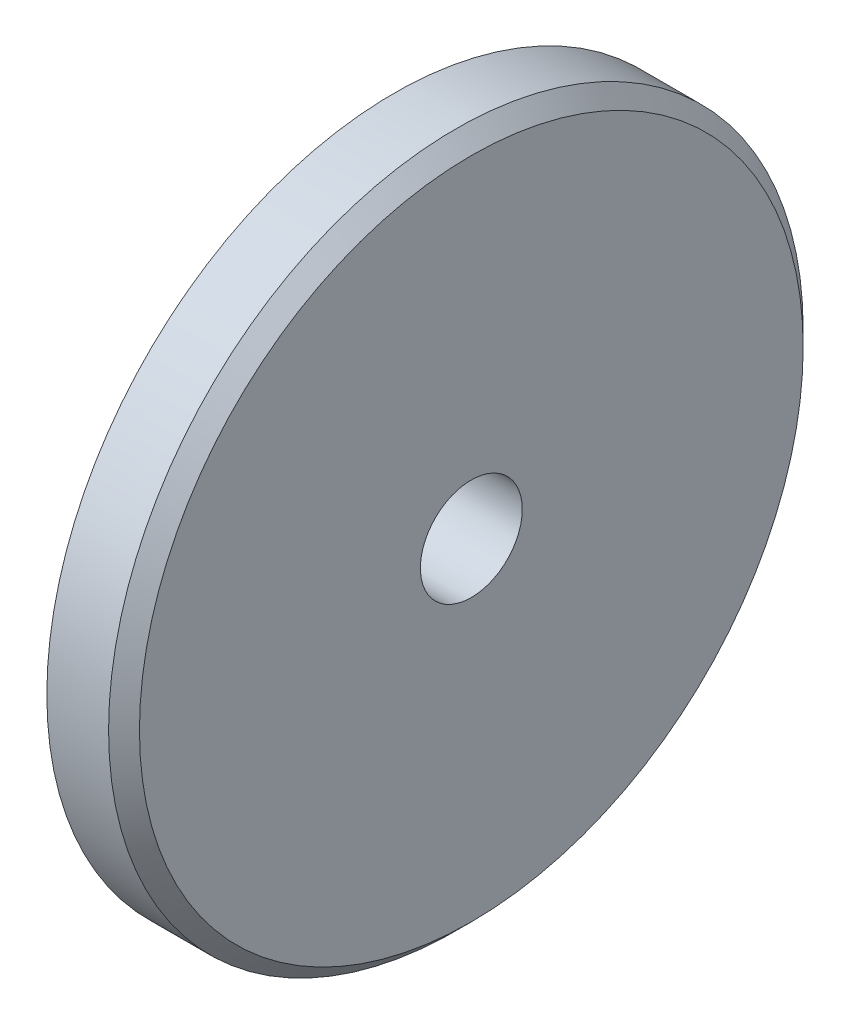
ISO-10303-21;
HEADER;
FILE_DESCRIPTION(('STEP AP214'),'2;1');
FILE_NAME('part.step','',(''),(''),'','','');
FILE_SCHEMA(('AUTOMOTIVE_DESIGN { 1 0 10303 214 1 1 1 1 }'));
ENDSEC;
DATA;
#1=APPLICATION_CONTEXT('core data for automotive mechanical design processes');
#2=APPLICATION_PROTOCOL_DEFINITION('international standard','automotive_design',2000,#1);
#3=PRODUCT_CONTEXT('',#1,'mechanical');
#4=PRODUCT('Part','Part','',(#3));
#5=PRODUCT_RELATED_PRODUCT_CATEGORY('part','',(#4));
#6=PRODUCT_DEFINITION_FORMATION('','',#4);
#7=PRODUCT_DEFINITION_CONTEXT('part definition',#1,'design');
#8=PRODUCT_DEFINITION('design','',#6,#7);
#9=PRODUCT_DEFINITION_SHAPE('','',#8);
#10=(LENGTH_UNIT() NAMED_UNIT(*) SI_UNIT(.MILLI.,.METRE.));
#11=(NAMED_UNIT(*) PLANE_ANGLE_UNIT() SI_UNIT($,.RADIAN.));
#12=(NAMED_UNIT(*) SI_UNIT($,.STERADIAN.) SOLID_ANGLE_UNIT());
#13=UNCERTAINTY_MEASURE_WITH_UNIT(LENGTH_MEASURE(1.E-05),#10,'distance_accuracy_value','');
#14=(GEOMETRIC_REPRESENTATION_CONTEXT(3) GLOBAL_UNCERTAINTY_ASSIGNED_CONTEXT((#13)) GLOBAL_UNIT_ASSIGNED_CONTEXT((#10,
#11,#12)) REPRESENTATION_CONTEXT('',''));
#15=CARTESIAN_POINT('',(0.,0.,0.));
#16=DIRECTION('',(0.,0.,1.));
#17=DIRECTION('',(1.,0.,0.));
#18=AXIS2_PLACEMENT_3D('',#15,#16,#17);
#19=CARTESIAN_POINT('',(5.,0.,0.));
#20=DIRECTION('',(1.,0.,0.));
#21=DIRECTION('',(0.,0.,-1.));
#22=AXIS2_PLACEMENT_3D('',#19,#20,#21);
#23=PLANE('',#22);
#24=CARTESIAN_POINT('',(5.,0.,0.));
#25=DIRECTION('',(1.,0.,0.));
#26=DIRECTION('',(0.,0.,-1.));
#27=AXIS2_PLACEMENT_3D('',#24,#25,#26);
#28=CIRCLE('',#27,21.5);
#29=CARTESIAN_POINT('',(5.,0.,-21.5));
#30=VERTEX_POINT('',#29);
#31=EDGE_CURVE('E39',#30,#30,#28,.T.);
#32=ORIENTED_EDGE('',*,*,#31,.T.);
#33=EDGE_LOOP('',(#32));
#34=FACE_BOUND('',#33,.T.);
#35=CARTESIAN_POINT('',(5.,0.,0.));
#36=DIRECTION('',(1.,0.,0.));
#37=DIRECTION('',(0.,0.,-1.));
#38=AXIS2_PLACEMENT_3D('',#35,#36,#37);
#39=CIRCLE('',#38,3.3);
#40=CARTESIAN_POINT('',(5.,0.,-3.3));
#41=VERTEX_POINT('',#40);
#42=EDGE_CURVE('E47',#41,#41,#39,.T.);
#43=ORIENTED_EDGE('',*,*,#42,.F.);
#44=EDGE_LOOP('',(#43));
#45=FACE_BOUND('',#44,.T.);
#46=ADVANCED_FACE('F32',(#34,#45),#23,.T.);
#47=CARTESIAN_POINT('',(0.,0.,0.));
#48=DIRECTION('',(1.,0.,0.));
#49=DIRECTION('',(0.,0.,-1.));
#50=AXIS2_PLACEMENT_3D('',#47,#48,#49);
#51=PLANE('',#50);
#52=CARTESIAN_POINT('',(0.,0.,0.));
#53=DIRECTION('',(1.,0.,0.));
#54=DIRECTION('',(0.,0.,-1.));
#55=AXIS2_PLACEMENT_3D('',#52,#53,#54);
#56=CIRCLE('',#55,22.5);
#57=CARTESIAN_POINT('',(0.,0.,-22.5));
#58=VERTEX_POINT('',#57);
#59=EDGE_CURVE('E43',#58,#58,#56,.T.);
#60=ORIENTED_EDGE('',*,*,#59,.F.);
#61=EDGE_LOOP('',(#60));
#62=FACE_BOUND('',#61,.T.);
#63=CARTESIAN_POINT('',(0.,0.,0.));
#64=DIRECTION('',(1.,0.,0.));
#65=DIRECTION('',(0.,0.,-1.));
#66=AXIS2_PLACEMENT_3D('',#63,#64,#65);
#67=CIRCLE('',#66,3.3);
#68=CARTESIAN_POINT('',(0.,0.,-3.3));
#69=VERTEX_POINT('',#68);
#70=EDGE_CURVE('E50',#69,#69,#67,.T.);
#71=ORIENTED_EDGE('',*,*,#70,.T.);
#72=EDGE_LOOP('',(#71));
#73=FACE_BOUND('',#72,.T.);
#74=ADVANCED_FACE('F60',(#62,#73),#51,.F.);
#75=CARTESIAN_POINT('',(5.,0.,0.));
#76=DIRECTION('',(-1.,0.,0.));
#77=DIRECTION('',(0.,0.,1.));
#78=AXIS2_PLACEMENT_3D('',#75,#76,#77);
#79=CYLINDRICAL_SURFACE('',#78,22.5);
#80=CARTESIAN_POINT('',(4.00000000000001,0.,0.));
#81=DIRECTION('',(1.,0.,0.));
#82=DIRECTION('',(0.,0.,-1.));
#83=AXIS2_PLACEMENT_3D('',#80,#81,#82);
#84=CIRCLE('',#83,22.5);
#85=CARTESIAN_POINT('',(4.00000000000001,0.,-22.5));
#86=VERTEX_POINT('',#85);
#87=EDGE_CURVE('E10',#86,#86,#84,.F.);
#88=ORIENTED_EDGE('',*,*,#87,.T.);
#89=EDGE_LOOP('',(#88));
#90=FACE_BOUND('',#89,.T.);
#91=ORIENTED_EDGE('',*,*,#59,.T.);
#92=EDGE_LOOP('',(#91));
#93=FACE_BOUND('',#92,.T.);
#94=ADVANCED_FACE('F65',(#90,#93),#79,.T.);
#95=CARTESIAN_POINT('',(5.,0.,0.));
#96=DIRECTION('',(-1.,0.,0.));
#97=DIRECTION('',(0.,0.,1.));
#98=AXIS2_PLACEMENT_3D('',#95,#96,#97);
#99=CYLINDRICAL_SURFACE('',#98,3.3);
#100=ORIENTED_EDGE('',*,*,#42,.T.);
#101=EDGE_LOOP('',(#100));
#102=FACE_BOUND('',#101,.T.);
#103=ORIENTED_EDGE('',*,*,#70,.F.);
#104=EDGE_LOOP('',(#103));
#105=FACE_BOUND('',#104,.T.);
#106=ADVANCED_FACE('F56',(#102,#105),#99,.F.);
#107=CARTESIAN_POINT('',(5.,0.,0.));
#108=DIRECTION('',(-1.,0.,0.));
#109=DIRECTION('',(0.,0.,1.));
#110=AXIS2_PLACEMENT_3D('',#107,#108,#109);
#111=CONICAL_SURFACE('',#110,21.5,0.785398163397443);
#112=ORIENTED_EDGE('',*,*,#87,.F.);
#113=EDGE_LOOP('',(#112));
#114=FACE_BOUND('',#113,.T.);
#115=ORIENTED_EDGE('',*,*,#31,.F.);
#116=EDGE_LOOP('',(#115));
#117=FACE_BOUND('',#116,.T.);
#118=ADVANCED_FACE('F34',(#114,#117),#111,.T.);
#119=CLOSED_SHELL('',(#46,#74,#94,#106,#118));
#120=MANIFOLD_SOLID_BREP('B2',#119);
#121=ADVANCED_BREP_SHAPE_REPRESENTATION('',(#18,#120),#14);
#122=SHAPE_DEFINITION_REPRESENTATION(#9,#121);
ENDSEC;
END-ISO-10303-21;
